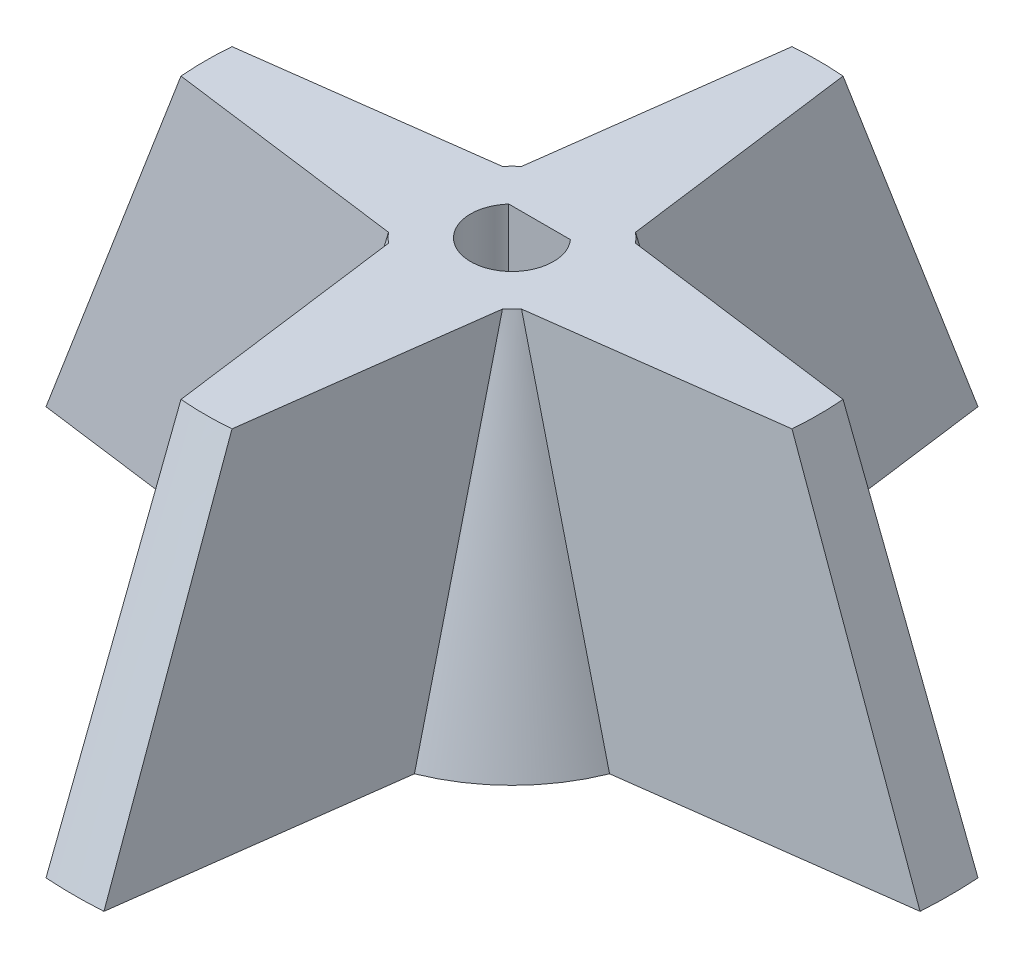
ISO-10303-21;
HEADER;
FILE_DESCRIPTION(('STEP AP214'),'2;1');
FILE_NAME('part.step','',(''),(''),'','','');
FILE_SCHEMA(('AUTOMOTIVE_DESIGN { 1 0 10303 214 1 1 1 1 }'));
ENDSEC;
DATA;
#1=APPLICATION_CONTEXT('core data for automotive mechanical design processes');
#2=APPLICATION_PROTOCOL_DEFINITION('international standard','automotive_design',2000,#1);
#3=PRODUCT_CONTEXT('',#1,'mechanical');
#4=PRODUCT('Part','Part','',(#3));
#5=PRODUCT_RELATED_PRODUCT_CATEGORY('part','',(#4));
#6=PRODUCT_DEFINITION_FORMATION('','',#4);
#7=PRODUCT_DEFINITION_CONTEXT('part definition',#1,'design');
#8=PRODUCT_DEFINITION('design','',#6,#7);
#9=PRODUCT_DEFINITION_SHAPE('','',#8);
#10=(LENGTH_UNIT() NAMED_UNIT(*) SI_UNIT(.MILLI.,.METRE.));
#11=(NAMED_UNIT(*) PLANE_ANGLE_UNIT() SI_UNIT($,.RADIAN.));
#12=(NAMED_UNIT(*) SI_UNIT($,.STERADIAN.) SOLID_ANGLE_UNIT());
#13=UNCERTAINTY_MEASURE_WITH_UNIT(LENGTH_MEASURE(1.E-05),#10,'distance_accuracy_value','');
#14=(GEOMETRIC_REPRESENTATION_CONTEXT(3) GLOBAL_UNCERTAINTY_ASSIGNED_CONTEXT((#13)) GLOBAL_UNIT_ASSIGNED_CONTEXT((#10,
#11,#12)) REPRESENTATION_CONTEXT('',''));
#15=CARTESIAN_POINT('',(0.,0.,0.));
#16=DIRECTION('',(0.,0.,1.));
#17=DIRECTION('',(1.,0.,0.));
#18=AXIS2_PLACEMENT_3D('',#15,#16,#17);
#19=CARTESIAN_POINT('',(0.,25.4,0.));
#20=DIRECTION('',(0.,-1.,0.));
#21=DIRECTION('',(0.,0.,-1.));
#22=AXIS2_PLACEMENT_3D('',#19,#20,#21);
#23=PLANE('',#22);
#24=CARTESIAN_POINT('',(0.,25.4,0.));
#25=DIRECTION('',(0.,-1.,0.));
#26=DIRECTION('',(0.,0.,-1.));
#27=AXIS2_PLACEMENT_3D('',#24,#25,#26);
#28=CIRCLE('',#27,6.35);
#29=CARTESIAN_POINT('',(4.82266666075305,25.4,4.13090622978313));
#30=VERTEX_POINT('',#29);
#31=CARTESIAN_POINT('',(4.13090622978313,25.4,4.82266666075305));
#32=VERTEX_POINT('',#31);
#33=EDGE_CURVE('E260',#30,#32,#28,.T.);
#34=ORIENTED_EDGE('',*,*,#33,.F.);
#35=DIRECTION('',(0.99144486137381,0.,-0.130526192220053));
#36=VECTOR('',#35,1.);
#37=CARTESIAN_POINT('',(4.82266666075305,25.4,4.13090622978313));
#38=LINE('',#37,#36);
#39=CARTESIAN_POINT('',(22.1478695363685,25.4,1.85));
#40=VERTEX_POINT('',#39);
#41=EDGE_CURVE('E554',#30,#40,#38,.T.);
#42=ORIENTED_EDGE('',*,*,#41,.T.);
#43=CARTESIAN_POINT('',(0.,25.4,0.));
#44=DIRECTION('',(0.,-1.,0.));
#45=DIRECTION('',(0.,0.,-1.));
#46=AXIS2_PLACEMENT_3D('',#43,#44,#45);
#47=CIRCLE('',#46,22.225);
#48=CARTESIAN_POINT('',(22.1478695363685,25.4,-1.85));
#49=VERTEX_POINT('',#48);
#50=EDGE_CURVE('E872',#49,#40,#47,.T.);
#51=ORIENTED_EDGE('',*,*,#50,.F.);
#52=DIRECTION('',(0.99144486137381,0.,0.130526192220053));
#53=VECTOR('',#52,1.);
#54=CARTESIAN_POINT('',(4.82266666075305,25.4,-4.13090622978313));
#55=LINE('',#54,#53);
#56=CARTESIAN_POINT('',(4.82266666075305,25.4,-4.13090622978313));
#57=VERTEX_POINT('',#56);
#58=EDGE_CURVE('E863',#57,#49,#55,.T.);
#59=ORIENTED_EDGE('',*,*,#58,.F.);
#60=CARTESIAN_POINT('',(0.,25.4,0.));
#61=DIRECTION('',(0.,-1.,0.));
#62=DIRECTION('',(0.,0.,-1.));
#63=AXIS2_PLACEMENT_3D('',#60,#61,#62);
#64=CIRCLE('',#63,6.35);
#65=CARTESIAN_POINT('',(4.13090622978313,25.4,-4.82266666075305));
#66=VERTEX_POINT('',#65);
#67=EDGE_CURVE('E854',#66,#57,#64,.T.);
#68=ORIENTED_EDGE('',*,*,#67,.F.);
#69=DIRECTION('',(0.130526192220054,0.,0.99144486137381));
#70=VECTOR('',#69,1.);
#71=CARTESIAN_POINT('',(1.84999999999998,25.4,-22.1478695363685));
#72=LINE('',#71,#70);
#73=CARTESIAN_POINT('',(1.84999999999998,25.4,-22.1478695363685));
#74=VERTEX_POINT('',#73);
#75=EDGE_CURVE('E846',#74,#66,#72,.T.);
#76=ORIENTED_EDGE('',*,*,#75,.F.);
#77=CARTESIAN_POINT('',(0.,25.4,0.));
#78=DIRECTION('',(0.,-1.,0.));
#79=DIRECTION('',(0.,0.,-1.));
#80=AXIS2_PLACEMENT_3D('',#77,#78,#79);
#81=CIRCLE('',#80,22.225);
#82=CARTESIAN_POINT('',(-1.85000000000002,25.4,-22.1478695363685));
#83=VERTEX_POINT('',#82);
#84=EDGE_CURVE('E685',#83,#74,#81,.T.);
#85=ORIENTED_EDGE('',*,*,#84,.F.);
#86=DIRECTION('',(0.130526192220052,0.,-0.99144486137381));
#87=VECTOR('',#86,1.);
#88=CARTESIAN_POINT('',(-4.13090622978313,25.4,-4.82266666075305));
#89=LINE('',#88,#87);
#90=CARTESIAN_POINT('',(-4.13090622978313,25.4,-4.82266666075304));
#91=VERTEX_POINT('',#90);
#92=EDGE_CURVE('E699',#91,#83,#89,.T.);
#93=ORIENTED_EDGE('',*,*,#92,.F.);
#94=CARTESIAN_POINT('',(0.,25.4,0.));
#95=DIRECTION('',(0.,-1.,0.));
#96=DIRECTION('',(0.,0.,-1.));
#97=AXIS2_PLACEMENT_3D('',#94,#95,#96);
#98=CIRCLE('',#97,6.35);
#99=CARTESIAN_POINT('',(-4.82266666075305,25.4,-4.13090622978313));
#100=VERTEX_POINT('',#99);
#101=EDGE_CURVE('E821',#100,#91,#98,.T.);
#102=ORIENTED_EDGE('',*,*,#101,.F.);
#103=DIRECTION('',(0.99144486137381,0.,-0.130526192220053));
#104=VECTOR('',#103,1.);
#105=CARTESIAN_POINT('',(-22.1478695363685,25.4,-1.85));
#106=LINE('',#105,#104);
#107=CARTESIAN_POINT('',(-22.1478695363685,25.4,-1.85));
#108=VERTEX_POINT('',#107);
#109=EDGE_CURVE('E823',#108,#100,#106,.T.);
#110=ORIENTED_EDGE('',*,*,#109,.F.);
#111=CARTESIAN_POINT('',(0.,25.4,0.));
#112=DIRECTION('',(0.,-1.,0.));
#113=DIRECTION('',(0.,0.,-1.));
#114=AXIS2_PLACEMENT_3D('',#111,#112,#113);
#115=CIRCLE('',#114,22.225);
#116=CARTESIAN_POINT('',(-22.1478695363685,25.4,1.85));
#117=VERTEX_POINT('',#116);
#118=EDGE_CURVE('E790',#117,#108,#115,.T.);
#119=ORIENTED_EDGE('',*,*,#118,.F.);
#120=DIRECTION('',(0.99144486137381,0.,0.130526192220053));
#121=VECTOR('',#120,1.);
#122=CARTESIAN_POINT('',(-22.1478695363685,25.4,1.85));
#123=LINE('',#122,#121);
#124=CARTESIAN_POINT('',(-4.82266666075305,25.4,4.13090622978313));
#125=VERTEX_POINT('',#124);
#126=EDGE_CURVE('E799',#117,#125,#123,.T.);
#127=ORIENTED_EDGE('',*,*,#126,.T.);
#128=CARTESIAN_POINT('',(0.,25.4,0.));
#129=DIRECTION('',(0.,-1.,0.));
#130=DIRECTION('',(0.,0.,-1.));
#131=AXIS2_PLACEMENT_3D('',#128,#129,#130);
#132=CIRCLE('',#131,6.35);
#133=CARTESIAN_POINT('',(-4.13090622978313,25.4,4.82266666075305));
#134=VERTEX_POINT('',#133);
#135=EDGE_CURVE('E454',#134,#125,#132,.T.);
#136=ORIENTED_EDGE('',*,*,#135,.F.);
#137=DIRECTION('',(0.130526192220053,0.,0.99144486137381));
#138=VECTOR('',#137,1.);
#139=CARTESIAN_POINT('',(-4.13090622978313,25.4,4.82266666075305));
#140=LINE('',#139,#138);
#141=CARTESIAN_POINT('',(-1.85,25.4,22.1478695363685));
#142=VERTEX_POINT('',#141);
#143=EDGE_CURVE('E505',#134,#142,#140,.T.);
#144=ORIENTED_EDGE('',*,*,#143,.T.);
#145=CARTESIAN_POINT('',(0.,25.4,0.));
#146=DIRECTION('',(0.,-1.,0.));
#147=DIRECTION('',(0.,0.,-1.));
#148=AXIS2_PLACEMENT_3D('',#145,#146,#147);
#149=CIRCLE('',#148,22.225);
#150=CARTESIAN_POINT('',(1.85,25.4,22.1478695363685));
#151=VERTEX_POINT('',#150);
#152=EDGE_CURVE('E518',#151,#142,#149,.T.);
#153=ORIENTED_EDGE('',*,*,#152,.F.);
#154=DIRECTION('',(-0.130526192220053,0.,0.99144486137381));
#155=VECTOR('',#154,1.);
#156=CARTESIAN_POINT('',(4.13090622978313,25.4,4.82266666075305));
#157=LINE('',#156,#155);
#158=EDGE_CURVE('E529',#32,#151,#157,.T.);
#159=ORIENTED_EDGE('',*,*,#158,.F.);
#160=EDGE_LOOP('',(#34,#42,#51,#59,#68,#76,#85,#93,#102,#110,#119,#127,#136,#144,#153,#159));
#161=FACE_BOUND('',#160,.T.);
#162=CARTESIAN_POINT('',(0.,25.4,0.));
#163=DIRECTION('',(0.,-1.,0.));
#164=DIRECTION('',(0.,0.,-1.));
#165=AXIS2_PLACEMENT_3D('',#162,#163,#164);
#166=CIRCLE('',#165,3.);
#167=CARTESIAN_POINT('',(-2.23606797749979,25.4,-2.));
#168=VERTEX_POINT('',#167);
#169=CARTESIAN_POINT('',(2.23606797749979,25.4,-2.));
#170=VERTEX_POINT('',#169);
#171=EDGE_CURVE('E198',#168,#170,#166,.F.);
#172=ORIENTED_EDGE('',*,*,#171,.F.);
#173=DIRECTION('',(-1.,0.,0.));
#174=VECTOR('',#173,1.);
#175=CARTESIAN_POINT('',(0.,25.4,-2.));
#176=LINE('',#175,#174);
#177=EDGE_CURVE('E194',#170,#168,#176,.T.);
#178=ORIENTED_EDGE('',*,*,#177,.F.);
#179=EDGE_LOOP('',(#172,#178));
#180=FACE_BOUND('',#179,.T.);
#181=ADVANCED_FACE('F73',(#161,#180),#23,.F.);
#182=CARTESIAN_POINT('',(0.,0.,0.));
#183=DIRECTION('',(0.,1.,0.));
#184=DIRECTION('',(0.,0.,1.));
#185=AXIS2_PLACEMENT_3D('',#182,#183,#184);
#186=PLANE('',#185);
#187=CARTESIAN_POINT('',(0.,0.,0.));
#188=DIRECTION('',(0.,1.,0.));
#189=DIRECTION('',(0.,0.,1.));
#190=AXIS2_PLACEMENT_3D('',#187,#188,#189);
#191=CIRCLE('',#190,12.7);
#192=CARTESIAN_POINT('',(4.7185103496318,0.,11.7909143021403));
#193=VERTEX_POINT('',#192);
#194=CARTESIAN_POINT('',(11.7909143021403,0.,4.71851034963179));
#195=VERTEX_POINT('',#194);
#196=EDGE_CURVE('E205',#193,#195,#191,.T.);
#197=ORIENTED_EDGE('',*,*,#196,.F.);
#198=DIRECTION('',(-0.130526192220052,0.,0.99144486137381));
#199=VECTOR('',#198,1.);
#200=CARTESIAN_POINT('',(4.7185103496318,0.,11.7909143021403));
#201=LINE('',#200,#199);
#202=CARTESIAN_POINT('',(2.1,0.,31.6804750595694));
#203=VERTEX_POINT('',#202);
#204=EDGE_CURVE('E217',#193,#203,#201,.T.);
#205=ORIENTED_EDGE('',*,*,#204,.T.);
#206=CARTESIAN_POINT('',(0.,0.,0.));
#207=DIRECTION('',(0.,-1.,0.));
#208=DIRECTION('',(0.,0.,-1.));
#209=AXIS2_PLACEMENT_3D('',#206,#207,#208);
#210=CIRCLE('',#209,31.75);
#211=CARTESIAN_POINT('',(-2.1,0.,31.6804750595694));
#212=VERTEX_POINT('',#211);
#213=EDGE_CURVE('E275',#203,#212,#210,.T.);
#214=ORIENTED_EDGE('',*,*,#213,.T.);
#215=DIRECTION('',(-0.130526192220052,0.,-0.99144486137381));
#216=VECTOR('',#215,1.);
#217=CARTESIAN_POINT('',(-2.1,0.,31.6804750595694));
#218=LINE('',#217,#216);
#219=CARTESIAN_POINT('',(-4.7185103496318,0.,11.7909143021403));
#220=VERTEX_POINT('',#219);
#221=EDGE_CURVE('E431',#212,#220,#218,.T.);
#222=ORIENTED_EDGE('',*,*,#221,.T.);
#223=CARTESIAN_POINT('',(0.,0.,0.));
#224=DIRECTION('',(0.,1.,0.));
#225=DIRECTION('',(0.,0.,1.));
#226=AXIS2_PLACEMENT_3D('',#223,#224,#225);
#227=CIRCLE('',#226,12.7);
#228=CARTESIAN_POINT('',(-11.7909143021403,0.,4.71851034963179));
#229=VERTEX_POINT('',#228);
#230=EDGE_CURVE('E427',#229,#220,#227,.T.);
#231=ORIENTED_EDGE('',*,*,#230,.F.);
#232=DIRECTION('',(0.99144486137381,0.,0.130526192220051));
#233=VECTOR('',#232,1.);
#234=CARTESIAN_POINT('',(-31.6804750595694,0.,2.1));
#235=LINE('',#234,#233);
#236=CARTESIAN_POINT('',(-31.6804750595694,0.,2.10000000000001));
#237=VERTEX_POINT('',#236);
#238=EDGE_CURVE('E423',#237,#229,#235,.T.);
#239=ORIENTED_EDGE('',*,*,#238,.F.);
#240=CARTESIAN_POINT('',(0.,0.,0.));
#241=DIRECTION('',(0.,-1.,0.));
#242=DIRECTION('',(0.,0.,-1.));
#243=AXIS2_PLACEMENT_3D('',#240,#241,#242);
#244=CIRCLE('',#243,31.75);
#245=CARTESIAN_POINT('',(-31.6804750595694,0.,-2.1));
#246=VERTEX_POINT('',#245);
#247=EDGE_CURVE('E420',#237,#246,#244,.T.);
#248=ORIENTED_EDGE('',*,*,#247,.T.);
#249=DIRECTION('',(0.99144486137381,0.,-0.130526192220051));
#250=VECTOR('',#249,1.);
#251=CARTESIAN_POINT('',(-31.6804750595694,0.,-2.1));
#252=LINE('',#251,#250);
#253=CARTESIAN_POINT('',(-11.7909143021403,0.,-4.71851034963179));
#254=VERTEX_POINT('',#253);
#255=EDGE_CURVE('E417',#246,#254,#252,.T.);
#256=ORIENTED_EDGE('',*,*,#255,.T.);
#257=CARTESIAN_POINT('',(0.,0.,0.));
#258=DIRECTION('',(0.,1.,0.));
#259=DIRECTION('',(0.,0.,1.));
#260=AXIS2_PLACEMENT_3D('',#257,#258,#259);
#261=CIRCLE('',#260,12.7);
#262=CARTESIAN_POINT('',(-4.7185103496318,0.,-11.7909143021403));
#263=VERTEX_POINT('',#262);
#264=EDGE_CURVE('E413',#263,#254,#261,.T.);
#265=ORIENTED_EDGE('',*,*,#264,.F.);
#266=DIRECTION('',(0.130526192220052,0.,-0.99144486137381));
#267=VECTOR('',#266,1.);
#268=CARTESIAN_POINT('',(-4.7185103496318,0.,-11.7909143021403));
#269=LINE('',#268,#267);
#270=CARTESIAN_POINT('',(-2.10000000000001,0.,-31.6804750595694));
#271=VERTEX_POINT('',#270);
#272=EDGE_CURVE('E410',#263,#271,#269,.T.);
#273=ORIENTED_EDGE('',*,*,#272,.T.);
#274=CARTESIAN_POINT('',(0.,0.,0.));
#275=DIRECTION('',(0.,-1.,0.));
#276=DIRECTION('',(0.,0.,-1.));
#277=AXIS2_PLACEMENT_3D('',#274,#275,#276);
#278=CIRCLE('',#277,31.75);
#279=CARTESIAN_POINT('',(2.1,0.,-31.6804750595694));
#280=VERTEX_POINT('',#279);
#281=EDGE_CURVE('E407',#271,#280,#278,.T.);
#282=ORIENTED_EDGE('',*,*,#281,.T.);
#283=DIRECTION('',(0.130526192220052,0.,0.99144486137381));
#284=VECTOR('',#283,1.);
#285=CARTESIAN_POINT('',(2.1,0.,-31.6804750595694));
#286=LINE('',#285,#284);
#287=CARTESIAN_POINT('',(4.7185103496318,0.,-11.7909143021403));
#288=VERTEX_POINT('',#287);
#289=EDGE_CURVE('E404',#280,#288,#286,.T.);
#290=ORIENTED_EDGE('',*,*,#289,.T.);
#291=CARTESIAN_POINT('',(0.,0.,0.));
#292=DIRECTION('',(0.,-1.,0.));
#293=DIRECTION('',(0.,0.,-1.));
#294=AXIS2_PLACEMENT_3D('',#291,#292,#293);
#295=CIRCLE('',#294,12.7);
#296=CARTESIAN_POINT('',(11.7909143021403,0.,-4.71851034963179));
#297=VERTEX_POINT('',#296);
#298=EDGE_CURVE('E401',#288,#297,#295,.T.);
#299=ORIENTED_EDGE('',*,*,#298,.T.);
#300=DIRECTION('',(0.99144486137381,0.,0.130526192220051));
#301=VECTOR('',#300,1.);
#302=CARTESIAN_POINT('',(11.7909143021403,0.,-4.71851034963179));
#303=LINE('',#302,#301);
#304=CARTESIAN_POINT('',(31.6804750595694,0.,-2.1));
#305=VERTEX_POINT('',#304);
#306=EDGE_CURVE('E398',#297,#305,#303,.T.);
#307=ORIENTED_EDGE('',*,*,#306,.T.);
#308=CARTESIAN_POINT('',(0.,0.,0.));
#309=DIRECTION('',(0.,-1.,0.));
#310=DIRECTION('',(0.,0.,-1.));
#311=AXIS2_PLACEMENT_3D('',#308,#309,#310);
#312=CIRCLE('',#311,31.75);
#313=CARTESIAN_POINT('',(31.6804750595694,0.,2.1));
#314=VERTEX_POINT('',#313);
#315=EDGE_CURVE('E396',#305,#314,#312,.T.);
#316=ORIENTED_EDGE('',*,*,#315,.T.);
#317=DIRECTION('',(0.99144486137381,0.,-0.130526192220051));
#318=VECTOR('',#317,1.);
#319=CARTESIAN_POINT('',(11.7909143021403,0.,4.71851034963179));
#320=LINE('',#319,#318);
#321=EDGE_CURVE('E208',#195,#314,#320,.T.);
#322=ORIENTED_EDGE('',*,*,#321,.F.);
#323=EDGE_LOOP('',(#197,#205,#214,#222,#231,#239,#248,#256,#265,#273,#282,#290,#299,#307,#316,#322));
#324=FACE_BOUND('',#323,.T.);
#325=CARTESIAN_POINT('',(0.,0.,0.));
#326=DIRECTION('',(0.,1.,0.));
#327=DIRECTION('',(0.,0.,1.));
#328=AXIS2_PLACEMENT_3D('',#325,#326,#327);
#329=CIRCLE('',#328,3.);
#330=CARTESIAN_POINT('',(2.23606797749979,0.,-2.));
#331=VERTEX_POINT('',#330);
#332=CARTESIAN_POINT('',(-2.23606797749979,0.,-2.));
#333=VERTEX_POINT('',#332);
#334=EDGE_CURVE('E12',#331,#333,#329,.F.);
#335=ORIENTED_EDGE('',*,*,#334,.F.);
#336=DIRECTION('',(1.,0.,0.));
#337=VECTOR('',#336,1.);
#338=CARTESIAN_POINT('',(0.,0.,-2.));
#339=LINE('',#338,#337);
#340=EDGE_CURVE('E81',#333,#331,#339,.T.);
#341=ORIENTED_EDGE('',*,*,#340,.F.);
#342=EDGE_LOOP('',(#335,#341));
#343=FACE_BOUND('',#342,.T.);
#344=ADVANCED_FACE('F288',(#324,#343),#186,.F.);
#345=CARTESIAN_POINT('',(31.6804750595694,0.,2.1));
#346=CARTESIAN_POINT('',(22.1478695363685,25.4,1.85));
#347=CARTESIAN_POINT('',(31.7732088613972,0.,0.701023382864757));
#348=CARTESIAN_POINT('',(22.2507697761346,25.4,0.618096710486658));
#349=CARTESIAN_POINT('',(31.7732088613972,0.,-0.701023382864761));
#350=CARTESIAN_POINT('',(22.2507697761346,25.4,-0.618096710486655));
#351=CARTESIAN_POINT('',(31.6804750595694,0.,-2.1));
#352=CARTESIAN_POINT('',(22.1478695363685,25.4,-1.85));
#353=(BOUNDED_SURFACE() B_SPLINE_SURFACE(3,1,((#345,#346),(#347,#348),(#349,#350),(#351,#352)),
.UNSPECIFIED.,.F.,.F.,.F.) B_SPLINE_SURFACE_WITH_KNOTS((4,4),(2,2),(0.,1.),(0.,1.),
.UNSPECIFIED.) GEOMETRIC_REPRESENTATION_ITEM() RATIONAL_B_SPLINE_SURFACE(((1.,1.),
(0.998540158731116,0.997686375294143),(0.998540158731116,0.997686375294143),(1.,1.))) REPRESENTATION_ITEM('') SURFACE());
#354=DIRECTION('',(-0.351354287520318,0.936197231837134,0.00921453968343655));
#355=VECTOR('',#354,1.);
#356=CARTESIAN_POINT('',(26.914172297969,12.7,-1.975));
#357=LINE('',#356,#355);
#358=EDGE_CURVE('E591',#305,#49,#357,.T.);
#359=DIRECTION('',(0.351354287520318,-0.936197231837134,0.00921453968343632));
#360=VECTOR('',#359,1.);
#361=CARTESIAN_POINT('',(26.914172297969,12.7,1.975));
#362=LINE('',#361,#360);
#363=EDGE_CURVE('E274',#40,#314,#362,.T.);
#364=ORIENTED_EDGE('',*,*,#315,.F.);
#365=ORIENTED_EDGE('',*,*,#358,.T.);
#366=ORIENTED_EDGE('',*,*,#50,.T.);
#367=ORIENTED_EDGE('',*,*,#363,.T.);
#368=EDGE_LOOP('',(#364,#365,#366,#367));
#369=FACE_BOUND('',#368,.T.);
#370=ADVANCED_FACE('F298',(#369),#353,.T.);
#371=CARTESIAN_POINT('',(0.808712183520945,0.363969643732636,-6.14277889399009));
#372=DIRECTION('',(0.130301554286262,0.0586436203853126,-0.989738566864345));
#373=DIRECTION('',(-0.99144486137381,0.,-0.130526192220053));
#374=AXIS2_PLACEMENT_3D('',#371,#372,#373);
#375=PLANE('',#374);
#376=DIRECTION('',(-0.264499295619334,0.964127920602081,0.0223041550475159));
#377=VECTOR('',#376,1.);
#378=CARTESIAN_POINT('',(11.7909143021403,0.,-4.71851034963179));
#379=LINE('',#378,#377);
#380=EDGE_CURVE('E608',#297,#57,#379,.T.);
#381=ORIENTED_EDGE('',*,*,#380,.T.);
#382=ORIENTED_EDGE('',*,*,#58,.T.);
#383=ORIENTED_EDGE('',*,*,#358,.F.);
#384=ORIENTED_EDGE('',*,*,#306,.F.);
#385=EDGE_LOOP('',(#381,#382,#383,#384));
#386=FACE_BOUND('',#385,.T.);
#387=ADVANCED_FACE('F571',(#386),#375,.T.);
#388=CARTESIAN_POINT('',(0.808712183520949,0.363969643732646,6.14277889399012));
#389=DIRECTION('',(-0.130301554286262,-0.0586436203853139,-0.989738566864345));
#390=DIRECTION('',(-0.99144486137381,0.,0.130526192220053));
#391=AXIS2_PLACEMENT_3D('',#388,#389,#390);
#392=PLANE('',#391);
#393=ORIENTED_EDGE('',*,*,#363,.F.);
#394=ORIENTED_EDGE('',*,*,#41,.F.);
#395=DIRECTION('',(-0.264499295619334,0.964127920602081,-0.0223041550475158));
#396=VECTOR('',#395,1.);
#397=CARTESIAN_POINT('',(8.3067904814467,12.7,4.42470828970746));
#398=LINE('',#397,#396);
#399=EDGE_CURVE('E892',#195,#30,#398,.T.);
#400=ORIENTED_EDGE('',*,*,#399,.F.);
#401=ORIENTED_EDGE('',*,*,#321,.T.);
#402=EDGE_LOOP('',(#393,#394,#400,#401));
#403=FACE_BOUND('',#402,.T.);
#404=ADVANCED_FACE('F561',(#403),#392,.F.);
#405=CARTESIAN_POINT('',(11.7909143021403,0.,-4.71851034963179));
#406=CARTESIAN_POINT('',(4.82266666075305,25.4,-4.13090622978313));
#407=CARTESIAN_POINT('',(10.4817095481034,0.,-7.99003460516492));
#408=CARTESIAN_POINT('',(4.61010633348814,25.4,-4.37906185149837));
#409=CARTESIAN_POINT('',(7.99003460516493,0.,-10.4817095481034));
#410=CARTESIAN_POINT('',(4.37906185149837,25.4,-4.61010633348814));
#411=CARTESIAN_POINT('',(4.7185103496318,0.,-11.7909143021403));
#412=CARTESIAN_POINT('',(4.13090622978313,25.4,-4.82266666075305));
#413=(BOUNDED_SURFACE() B_SPLINE_SURFACE(3,1,((#405,#406),(#407,#408),(#409,#410),(#411,#412)),
.UNSPECIFIED.,.F.,.F.,.F.) B_SPLINE_SURFACE_WITH_KNOTS((4,4),(2,2),(0.,1.),(0.,1.),
.UNSPECIFIED.) GEOMETRIC_REPRESENTATION_ITEM() RATIONAL_B_SPLINE_SURFACE(((1.,1.),
(0.946137854317923,0.998019118818495),(0.946137854317923,0.998019118818495),(1.,1.))) REPRESENTATION_ITEM('') SURFACE());
#414=DIRECTION('',(-0.0223041550475163,0.964127920602081,0.264499295619334));
#415=VECTOR('',#414,1.);
#416=CARTESIAN_POINT('',(4.42470828970746,12.7,-8.30679048144669));
#417=LINE('',#416,#415);
#418=EDGE_CURVE('E625',#288,#66,#417,.T.);
#419=ORIENTED_EDGE('',*,*,#298,.F.);
#420=ORIENTED_EDGE('',*,*,#418,.T.);
#421=ORIENTED_EDGE('',*,*,#67,.T.);
#422=ORIENTED_EDGE('',*,*,#380,.F.);
#423=EDGE_LOOP('',(#419,#420,#421,#422));
#424=FACE_BOUND('',#423,.T.);
#425=ADVANCED_FACE('F570',(#424),#413,.T.);
#426=CARTESIAN_POINT('',(6.14277889399015,0.363969643732655,-0.80871218352096));
#427=DIRECTION('',(0.989738566864345,0.058643620385315,-0.130301554286263));
#428=DIRECTION('',(-0.130526192220054,0.,-0.99144486137381));
#429=AXIS2_PLACEMENT_3D('',#426,#427,#428);
#430=PLANE('',#429);
#431=DIRECTION('',(-0.00921453968343708,0.936197231837134,0.351354287520318));
#432=VECTOR('',#431,1.);
#433=CARTESIAN_POINT('',(2.1,0.,-31.6804750595694));
#434=LINE('',#433,#432);
#435=EDGE_CURVE('E642',#280,#74,#434,.T.);
#436=ORIENTED_EDGE('',*,*,#435,.T.);
#437=ORIENTED_EDGE('',*,*,#75,.T.);
#438=ORIENTED_EDGE('',*,*,#418,.F.);
#439=ORIENTED_EDGE('',*,*,#289,.F.);
#440=EDGE_LOOP('',(#436,#437,#438,#439));
#441=FACE_BOUND('',#440,.T.);
#442=ADVANCED_FACE('F654',(#441),#430,.T.);
#443=CARTESIAN_POINT('',(2.1,0.,-31.6804750595694));
#444=CARTESIAN_POINT('',(1.84999999999998,25.4,-22.1478695363685));
#445=CARTESIAN_POINT('',(0.701023382864759,0.,-31.7732088613972));
#446=CARTESIAN_POINT('',(0.618096710486638,25.4,-22.2507697761346));
#447=CARTESIAN_POINT('',(-0.701023382864767,0.,-31.7732088613972));
#448=CARTESIAN_POINT('',(-0.618096710486683,25.4,-22.2507697761346));
#449=CARTESIAN_POINT('',(-2.10000000000001,0.,-31.6804750595694));
#450=CARTESIAN_POINT('',(-1.85000000000003,25.4,-22.1478695363685));
#451=(BOUNDED_SURFACE() B_SPLINE_SURFACE(3,1,((#443,#444),(#445,#446),(#447,#448),(#449,#450)),
.UNSPECIFIED.,.F.,.F.,.F.) B_SPLINE_SURFACE_WITH_KNOTS((4,4),(2,2),(0.,1.),(0.,1.),
.UNSPECIFIED.) GEOMETRIC_REPRESENTATION_ITEM() RATIONAL_B_SPLINE_SURFACE(((1.,1.),
(0.998540158731116,0.997686375294143),(0.998540158731116,0.997686375294143),(1.,1.))) REPRESENTATION_ITEM('') SURFACE());
#452=DIRECTION('',(0.00921453968343572,0.936197231837134,0.351354287520318));
#453=VECTOR('',#452,1.);
#454=CARTESIAN_POINT('',(-1.97500000000002,12.7,-26.914172297969));
#455=LINE('',#454,#453);
#456=EDGE_CURVE('E735',#271,#83,#455,.T.);
#457=ORIENTED_EDGE('',*,*,#281,.F.);
#458=ORIENTED_EDGE('',*,*,#456,.T.);
#459=ORIENTED_EDGE('',*,*,#84,.T.);
#460=ORIENTED_EDGE('',*,*,#435,.F.);
#461=EDGE_LOOP('',(#457,#458,#459,#460));
#462=FACE_BOUND('',#461,.T.);
#463=ADVANCED_FACE('F663',(#462),#451,.T.);
#464=CARTESIAN_POINT('',(-6.14277889399008,0.363969643732635,-0.808712183520936));
#465=DIRECTION('',(-0.989738566864345,0.0586436203853125,-0.130301554286261));
#466=DIRECTION('',(-0.130526192220052,0.,0.99144486137381));
#467=AXIS2_PLACEMENT_3D('',#464,#465,#466);
#468=PLANE('',#467);
#469=DIRECTION('',(0.0223041550475161,0.964127920602081,0.264499295619334));
#470=VECTOR('',#469,1.);
#471=CARTESIAN_POINT('',(-4.7185103496318,0.,-11.7909143021403));
#472=LINE('',#471,#470);
#473=EDGE_CURVE('E727',#263,#91,#472,.T.);
#474=ORIENTED_EDGE('',*,*,#473,.T.);
#475=ORIENTED_EDGE('',*,*,#92,.T.);
#476=ORIENTED_EDGE('',*,*,#456,.F.);
#477=ORIENTED_EDGE('',*,*,#272,.F.);
#478=EDGE_LOOP('',(#474,#475,#476,#477));
#479=FACE_BOUND('',#478,.T.);
#480=ADVANCED_FACE('F705',(#479),#468,.T.);
#481=CARTESIAN_POINT('',(-4.71851034963179,0.,-11.7909143021403));
#482=CARTESIAN_POINT('',(-4.13090622978313,25.4,-4.82266666075304));
#483=CARTESIAN_POINT('',(-7.99003460516493,0.,-10.4817095481034));
#484=CARTESIAN_POINT('',(-4.37906185149837,25.4,-4.61010633348814));
#485=CARTESIAN_POINT('',(-10.4817095481034,0.,-7.99003460516493));
#486=CARTESIAN_POINT('',(-4.61010633348815,25.4,-4.37906185149837));
#487=CARTESIAN_POINT('',(-11.7909143021403,0.,-4.71851034963179));
#488=CARTESIAN_POINT('',(-4.82266666075305,25.4,-4.13090622978313));
#489=(BOUNDED_SURFACE() B_SPLINE_SURFACE(3,1,((#481,#482),(#483,#484),(#485,#486),(#487,#488)),
.UNSPECIFIED.,.F.,.F.,.F.) B_SPLINE_SURFACE_WITH_KNOTS((4,4),(2,2),(0.,1.),(0.,1.),
.UNSPECIFIED.) GEOMETRIC_REPRESENTATION_ITEM() RATIONAL_B_SPLINE_SURFACE(((1.,1.),
(0.946137854317923,0.998019118818495),(0.946137854317923,0.998019118818495),(1.,1.))) REPRESENTATION_ITEM('') SURFACE());
#490=DIRECTION('',(0.264499295619334,0.964127920602081,0.0223041550475162));
#491=VECTOR('',#490,1.);
#492=CARTESIAN_POINT('',(-8.3067904814467,12.7,-4.42470828970746));
#493=LINE('',#492,#491);
#494=EDGE_CURVE('E734',#254,#100,#493,.T.);
#495=ORIENTED_EDGE('',*,*,#264,.T.);
#496=ORIENTED_EDGE('',*,*,#494,.T.);
#497=ORIENTED_EDGE('',*,*,#101,.T.);
#498=ORIENTED_EDGE('',*,*,#473,.F.);
#499=EDGE_LOOP('',(#495,#496,#497,#498));
#500=FACE_BOUND('',#499,.T.);
#501=ADVANCED_FACE('F714',(#500),#489,.T.);
#502=CARTESIAN_POINT('',(-0.808712183520948,0.363969643732646,-6.14277889399012));
#503=DIRECTION('',(-0.130301554286262,0.0586436203853139,-0.989738566864345));
#504=DIRECTION('',(-0.99144486137381,0.,0.130526192220053));
#505=AXIS2_PLACEMENT_3D('',#502,#503,#504);
#506=PLANE('',#505);
#507=DIRECTION('',(0.351354287520318,0.936197231837134,0.00921453968343649));
#508=VECTOR('',#507,1.);
#509=CARTESIAN_POINT('',(-31.6804750595694,0.,-2.1));
#510=LINE('',#509,#508);
#511=EDGE_CURVE('E460',#246,#108,#510,.T.);
#512=ORIENTED_EDGE('',*,*,#511,.T.);
#513=ORIENTED_EDGE('',*,*,#109,.T.);
#514=ORIENTED_EDGE('',*,*,#494,.F.);
#515=ORIENTED_EDGE('',*,*,#255,.F.);
#516=EDGE_LOOP('',(#512,#513,#514,#515));
#517=FACE_BOUND('',#516,.T.);
#518=ADVANCED_FACE('F763',(#517),#506,.T.);
#519=CARTESIAN_POINT('',(-31.6804750595694,0.,-2.09999999999999));
#520=CARTESIAN_POINT('',(-22.1478695363685,25.4,-1.85));
#521=CARTESIAN_POINT('',(-31.7732088613972,0.,-0.701023382864753));
#522=CARTESIAN_POINT('',(-22.2507697761346,25.4,-0.618096710486653));
#523=CARTESIAN_POINT('',(-31.7732088613972,0.,0.701023382864764));
#524=CARTESIAN_POINT('',(-22.2507697761346,25.4,0.618096710486661));
#525=CARTESIAN_POINT('',(-31.6804750595694,0.,2.10000000000001));
#526=CARTESIAN_POINT('',(-22.1478695363685,25.4,1.85));
#527=(BOUNDED_SURFACE() B_SPLINE_SURFACE(3,1,((#519,#520),(#521,#522),(#523,#524),(#525,#526)),
.UNSPECIFIED.,.F.,.F.,.F.) B_SPLINE_SURFACE_WITH_KNOTS((4,4),(2,2),(0.,1.),(0.,1.),
.UNSPECIFIED.) GEOMETRIC_REPRESENTATION_ITEM() RATIONAL_B_SPLINE_SURFACE(((1.,1.),
(0.998540158731116,0.997686375294143),(0.998540158731116,0.997686375294143),(1.,1.))) REPRESENTATION_ITEM('') SURFACE());
#528=DIRECTION('',(0.351354287520318,0.936197231837134,-0.00921453968343639));
#529=VECTOR('',#528,1.);
#530=CARTESIAN_POINT('',(-26.914172297969,12.7,1.975));
#531=LINE('',#530,#529);
#532=EDGE_CURVE('E449',#237,#117,#531,.T.);
#533=ORIENTED_EDGE('',*,*,#247,.F.);
#534=ORIENTED_EDGE('',*,*,#532,.T.);
#535=ORIENTED_EDGE('',*,*,#118,.T.);
#536=ORIENTED_EDGE('',*,*,#511,.F.);
#537=EDGE_LOOP('',(#533,#534,#535,#536));
#538=FACE_BOUND('',#537,.T.);
#539=ADVANCED_FACE('F771',(#538),#527,.T.);
#540=CARTESIAN_POINT('',(-0.808712183520944,0.363969643732636,6.14277889399009));
#541=DIRECTION('',(0.130301554286262,-0.0586436203853127,-0.989738566864345));
#542=DIRECTION('',(-0.99144486137381,0.,-0.130526192220053));
#543=AXIS2_PLACEMENT_3D('',#540,#541,#542);
#544=PLANE('',#543);
#545=DIRECTION('',(0.264499295619334,0.964127920602081,-0.022304155047516));
#546=VECTOR('',#545,1.);
#547=CARTESIAN_POINT('',(-11.7909143021403,0.,4.71851034963179));
#548=LINE('',#547,#546);
#549=EDGE_CURVE('E447',#229,#125,#548,.T.);
#550=ORIENTED_EDGE('',*,*,#549,.T.);
#551=ORIENTED_EDGE('',*,*,#126,.F.);
#552=ORIENTED_EDGE('',*,*,#532,.F.);
#553=ORIENTED_EDGE('',*,*,#238,.T.);
#554=EDGE_LOOP('',(#550,#551,#552,#553));
#555=FACE_BOUND('',#554,.T.);
#556=ADVANCED_FACE('F445',(#555),#544,.F.);
#557=CARTESIAN_POINT('',(-11.7909143021403,0.,4.71851034963179));
#558=CARTESIAN_POINT('',(-4.82266666075304,25.4,4.13090622978313));
#559=CARTESIAN_POINT('',(-10.4817095481034,0.,7.99003460516492));
#560=CARTESIAN_POINT('',(-4.61010633348814,25.4,4.37906185149837));
#561=CARTESIAN_POINT('',(-7.99003460516494,0.,10.4817095481034));
#562=CARTESIAN_POINT('',(-4.37906185149837,25.4,4.61010633348814));
#563=CARTESIAN_POINT('',(-4.7185103496318,0.,11.7909143021403));
#564=CARTESIAN_POINT('',(-4.13090622978313,25.4,4.82266666075305));
#565=(BOUNDED_SURFACE() B_SPLINE_SURFACE(3,1,((#557,#558),(#559,#560),(#561,#562),(#563,#564)),
.UNSPECIFIED.,.F.,.F.,.F.) B_SPLINE_SURFACE_WITH_KNOTS((4,4),(2,2),(0.,1.),(0.,1.),
.UNSPECIFIED.) GEOMETRIC_REPRESENTATION_ITEM() RATIONAL_B_SPLINE_SURFACE(((1.,1.),
(0.946137854317923,0.998019118818495),(0.946137854317923,0.998019118818495),(1.,1.))) REPRESENTATION_ITEM('') SURFACE());
#566=DIRECTION('',(0.0223041550475165,0.964127920602081,-0.264499295619334));
#567=VECTOR('',#566,1.);
#568=CARTESIAN_POINT('',(-4.42470828970747,12.7,8.30679048144669));
#569=LINE('',#568,#567);
#570=EDGE_CURVE('E456',#220,#134,#569,.T.);
#571=ORIENTED_EDGE('',*,*,#230,.T.);
#572=ORIENTED_EDGE('',*,*,#570,.T.);
#573=ORIENTED_EDGE('',*,*,#135,.T.);
#574=ORIENTED_EDGE('',*,*,#549,.F.);
#575=EDGE_LOOP('',(#571,#572,#573,#574));
#576=FACE_BOUND('',#575,.T.);
#577=ADVANCED_FACE('F453',(#576),#565,.T.);
#578=CARTESIAN_POINT('',(-6.14277889399012,0.363969643732646,0.808712183520948));
#579=DIRECTION('',(0.989738566864345,-0.0586436203853139,-0.130301554286262));
#580=DIRECTION('',(-0.130526192220053,0.,-0.99144486137381));
#581=AXIS2_PLACEMENT_3D('',#578,#579,#580);
#582=PLANE('',#581);
#583=DIRECTION('',(0.00921453968343645,0.936197231837134,-0.351354287520318));
#584=VECTOR('',#583,1.);
#585=CARTESIAN_POINT('',(-2.1,0.,31.6804750595694));
#586=LINE('',#585,#584);
#587=EDGE_CURVE('E458',#212,#142,#586,.T.);
#588=ORIENTED_EDGE('',*,*,#587,.T.);
#589=ORIENTED_EDGE('',*,*,#143,.F.);
#590=ORIENTED_EDGE('',*,*,#570,.F.);
#591=ORIENTED_EDGE('',*,*,#221,.F.);
#592=EDGE_LOOP('',(#588,#589,#590,#591));
#593=FACE_BOUND('',#592,.T.);
#594=ADVANCED_FACE('F481',(#593),#582,.F.);
#595=CARTESIAN_POINT('',(-2.1,0.,31.6804750595694));
#596=CARTESIAN_POINT('',(-1.84999999999999,25.4,22.1478695363685));
#597=CARTESIAN_POINT('',(-0.701023382864755,0.,31.7732088613972));
#598=CARTESIAN_POINT('',(-0.618096710486652,25.4,22.2507697761346));
#599=CARTESIAN_POINT('',(0.701023382864762,0.,31.7732088613972));
#600=CARTESIAN_POINT('',(0.618096710486657,25.4,22.2507697761346));
#601=CARTESIAN_POINT('',(2.1,0.,31.6804750595694));
#602=CARTESIAN_POINT('',(1.84999999999999,25.4,22.1478695363685));
#603=(BOUNDED_SURFACE() B_SPLINE_SURFACE(3,1,((#595,#596),(#597,#598),(#599,#600),(#601,#602)),
.UNSPECIFIED.,.F.,.F.,.F.) B_SPLINE_SURFACE_WITH_KNOTS((4,4),(2,2),(0.,1.),(0.,1.),
.UNSPECIFIED.) GEOMETRIC_REPRESENTATION_ITEM() RATIONAL_B_SPLINE_SURFACE(((1.,1.),
(0.998540158731116,0.997686375294143),(0.998540158731116,0.997686375294143),(1.,1.))) REPRESENTATION_ITEM('') SURFACE());
#604=DIRECTION('',(-0.00921453968343674,0.936197231837134,-0.351354287520318));
#605=VECTOR('',#604,1.);
#606=CARTESIAN_POINT('',(1.975,12.7,26.914172297969));
#607=LINE('',#606,#605);
#608=EDGE_CURVE('E526',#203,#151,#607,.T.);
#609=ORIENTED_EDGE('',*,*,#213,.F.);
#610=ORIENTED_EDGE('',*,*,#608,.T.);
#611=ORIENTED_EDGE('',*,*,#152,.T.);
#612=ORIENTED_EDGE('',*,*,#587,.F.);
#613=EDGE_LOOP('',(#609,#610,#611,#612));
#614=FACE_BOUND('',#613,.T.);
#615=ADVANCED_FACE('F235',(#614),#603,.T.);
#616=CARTESIAN_POINT('',(6.1427788939901,0.36396964373264,0.808712183520946));
#617=DIRECTION('',(0.989738566864345,0.0586436203853131,0.130301554286262));
#618=DIRECTION('',(0.130526192220053,0.,-0.99144486137381));
#619=AXIS2_PLACEMENT_3D('',#616,#617,#618);
#620=PLANE('',#619);
#621=DIRECTION('',(-0.0223041550475163,0.964127920602081,-0.264499295619334));
#622=VECTOR('',#621,1.);
#623=CARTESIAN_POINT('',(4.7185103496318,0.,11.7909143021403));
#624=LINE('',#623,#622);
#625=EDGE_CURVE('E223',#193,#32,#624,.T.);
#626=ORIENTED_EDGE('',*,*,#625,.T.);
#627=ORIENTED_EDGE('',*,*,#158,.T.);
#628=ORIENTED_EDGE('',*,*,#608,.F.);
#629=ORIENTED_EDGE('',*,*,#204,.F.);
#630=EDGE_LOOP('',(#626,#627,#628,#629));
#631=FACE_BOUND('',#630,.T.);
#632=ADVANCED_FACE('F225',(#631),#620,.T.);
#633=CARTESIAN_POINT('',(4.7185103496318,0.,11.7909143021403));
#634=CARTESIAN_POINT('',(4.13090622978313,25.4,4.82266666075305));
#635=CARTESIAN_POINT('',(7.99003460516493,0.,10.4817095481034));
#636=CARTESIAN_POINT('',(4.37906185149837,25.4,4.61010633348814));
#637=CARTESIAN_POINT('',(10.4817095481034,0.,7.99003460516492));
#638=CARTESIAN_POINT('',(4.61010633348814,25.4,4.37906185149837));
#639=CARTESIAN_POINT('',(11.7909143021403,0.,4.71851034963179));
#640=CARTESIAN_POINT('',(4.82266666075305,25.4,4.13090622978313));
#641=(BOUNDED_SURFACE() B_SPLINE_SURFACE(3,1,((#633,#634),(#635,#636),(#637,#638),(#639,#640)),
.UNSPECIFIED.,.F.,.F.,.F.) B_SPLINE_SURFACE_WITH_KNOTS((4,4),(2,2),(0.,1.),(0.,1.),
.UNSPECIFIED.) GEOMETRIC_REPRESENTATION_ITEM() RATIONAL_B_SPLINE_SURFACE(((1.,1.),
(0.946137854317923,0.998019118818495),(0.946137854317923,0.998019118818495),(1.,1.))) REPRESENTATION_ITEM('') SURFACE());
#642=ORIENTED_EDGE('',*,*,#196,.T.);
#643=ORIENTED_EDGE('',*,*,#399,.T.);
#644=ORIENTED_EDGE('',*,*,#33,.T.);
#645=ORIENTED_EDGE('',*,*,#625,.F.);
#646=EDGE_LOOP('',(#642,#643,#644,#645));
#647=FACE_BOUND('',#646,.T.);
#648=ADVANCED_FACE('F234',(#647),#641,.T.);
#649=CARTESIAN_POINT('',(0.,-0.000100000000001735,0.));
#650=DIRECTION('',(0.,1.,0.));
#651=DIRECTION('',(0.,0.,1.));
#652=AXIS2_PLACEMENT_3D('',#649,#650,#651);
#653=CYLINDRICAL_SURFACE('',#652,3.);
#654=ORIENTED_EDGE('',*,*,#171,.T.);
#655=DIRECTION('',(0.,1.,0.));
#656=VECTOR('',#655,1.);
#657=CARTESIAN_POINT('',(2.23606797749979,-0.000100000000001735,-2.));
#658=LINE('',#657,#656);
#659=EDGE_CURVE('E88',#331,#170,#658,.T.);
#660=ORIENTED_EDGE('',*,*,#659,.F.);
#661=ORIENTED_EDGE('',*,*,#334,.T.);
#662=DIRECTION('',(0.,1.,0.));
#663=VECTOR('',#662,1.);
#664=CARTESIAN_POINT('',(-2.23606797749979,-0.000100000000001735,-2.));
#665=LINE('',#664,#663);
#666=EDGE_CURVE('E93',#333,#168,#665,.T.);
#667=ORIENTED_EDGE('',*,*,#666,.T.);
#668=EDGE_LOOP('',(#654,#660,#661,#667));
#669=FACE_BOUND('',#668,.T.);
#670=ADVANCED_FACE('F201',(#669),#653,.F.);
#671=CARTESIAN_POINT('',(0.,-0.000100000000001735,-2.));
#672=DIRECTION('',(0.,0.,1.));
#673=DIRECTION('',(1.,0.,0.));
#674=AXIS2_PLACEMENT_3D('',#671,#672,#673);
#675=PLANE('',#674);
#676=ORIENTED_EDGE('',*,*,#177,.T.);
#677=ORIENTED_EDGE('',*,*,#666,.F.);
#678=ORIENTED_EDGE('',*,*,#340,.T.);
#679=ORIENTED_EDGE('',*,*,#659,.T.);
#680=EDGE_LOOP('',(#676,#677,#678,#679));
#681=FACE_BOUND('',#680,.T.);
#682=ADVANCED_FACE('F195',(#681),#675,.T.);
#683=CLOSED_SHELL('',(#181,#344,#370,#387,#404,#425,#442,#463,#480,#501,#518,#539,#556,#577,
#594,#615,#632,#648,#670,#682));
#684=MANIFOLD_SOLID_BREP('B2',#683);
#685=ADVANCED_BREP_SHAPE_REPRESENTATION('',(#18,#684),#14);
#686=SHAPE_DEFINITION_REPRESENTATION(#9,#685);
ENDSEC;
END-ISO-10303-21;
